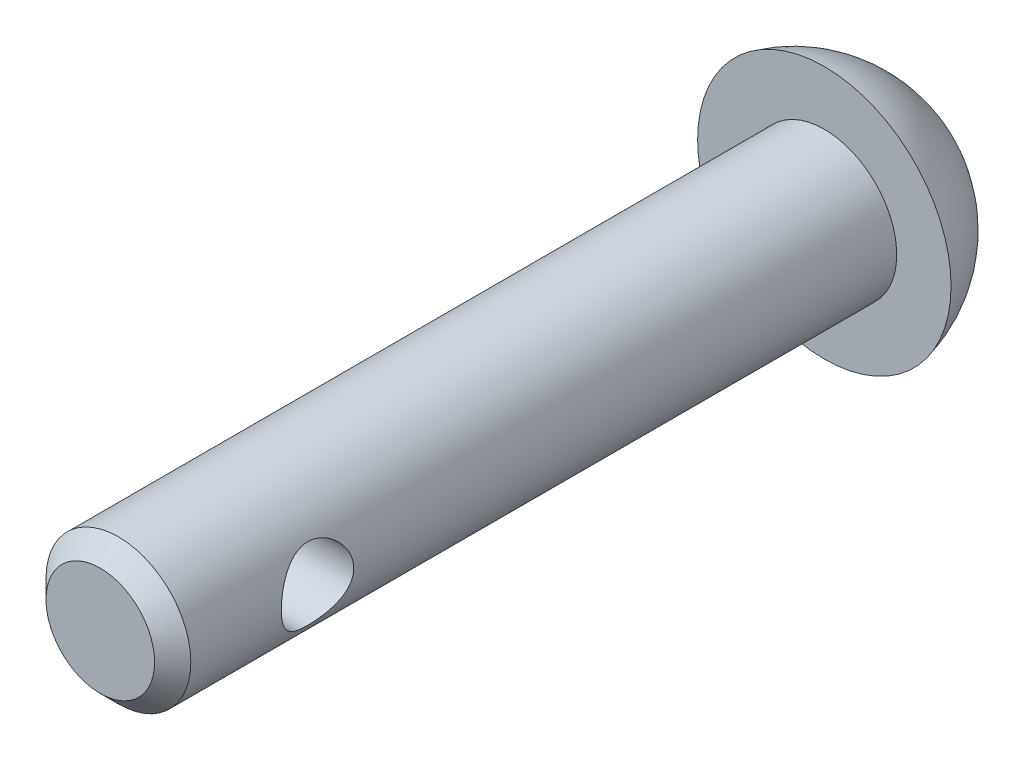
ISO-10303-21;
HEADER;
FILE_DESCRIPTION(('STEP AP214'),'2;1');
FILE_NAME('part.step','',(''),(''),'','','');
FILE_SCHEMA(('AUTOMOTIVE_DESIGN { 1 0 10303 214 1 1 1 1 }'));
ENDSEC;
DATA;
#1=APPLICATION_CONTEXT('core data for automotive mechanical design processes');
#2=APPLICATION_PROTOCOL_DEFINITION('international standard','automotive_design',2000,#1);
#3=PRODUCT_CONTEXT('',#1,'mechanical');
#4=PRODUCT('Part','Part','',(#3));
#5=PRODUCT_RELATED_PRODUCT_CATEGORY('part','',(#4));
#6=PRODUCT_DEFINITION_FORMATION('','',#4);
#7=PRODUCT_DEFINITION_CONTEXT('part definition',#1,'design');
#8=PRODUCT_DEFINITION('design','',#6,#7);
#9=PRODUCT_DEFINITION_SHAPE('','',#8);
#10=(LENGTH_UNIT() NAMED_UNIT(*) SI_UNIT(.MILLI.,.METRE.));
#11=(NAMED_UNIT(*) PLANE_ANGLE_UNIT() SI_UNIT($,.RADIAN.));
#12=(NAMED_UNIT(*) SI_UNIT($,.STERADIAN.) SOLID_ANGLE_UNIT());
#13=UNCERTAINTY_MEASURE_WITH_UNIT(LENGTH_MEASURE(1.E-05),#10,'distance_accuracy_value','');
#14=(GEOMETRIC_REPRESENTATION_CONTEXT(3) GLOBAL_UNCERTAINTY_ASSIGNED_CONTEXT((#13)) GLOBAL_UNIT_ASSIGNED_CONTEXT((#10,
#11,#12)) REPRESENTATION_CONTEXT('',''));
#15=CARTESIAN_POINT('',(0.,0.,0.));
#16=DIRECTION('',(0.,0.,1.));
#17=DIRECTION('',(1.,0.,0.));
#18=AXIS2_PLACEMENT_3D('',#15,#16,#17);
#19=CARTESIAN_POINT('',(0.,0.,10.));
#20=DIRECTION('',(0.,0.,-1.));
#21=DIRECTION('',(-1.,0.,0.));
#22=AXIS2_PLACEMENT_3D('',#19,#20,#21);
#23=CYLINDRICAL_SURFACE('',#22,2.);
#24=CARTESIAN_POINT('',(-2.,0.,7.));
#25=CARTESIAN_POINT('',(-1.99999713404151,-0.0525719629529865,6.9999966976805));
#26=CARTESIAN_POINT('',(-1.99790491019518,-0.105206599698033,6.99582992687832));
#27=CARTESIAN_POINT('',(-1.98974156037396,-0.208920235268425,6.97934711965908));
#28=CARTESIAN_POINT('',(-1.98366287828984,-0.259996086713504,6.96701560700235));
#29=CARTESIAN_POINT('',(-1.96816279403312,-0.358933544880574,6.9348061913832));
#30=CARTESIAN_POINT('',(-1.9587543917752,-0.40680680293918,6.91495761575199));
#31=CARTESIAN_POINT('',(-1.93745776515779,-0.498472616806565,6.86842937863506));
#32=CARTESIAN_POINT('',(-1.9255697363353,-0.54226549399005,6.84175025575115));
#33=CARTESIAN_POINT('',(-1.89956258258057,-0.627507817761919,6.7804827505147));
#34=CARTESIAN_POINT('',(-1.88535199127536,-0.668655211122112,6.74551352076036));
#35=CARTESIAN_POINT('',(-1.85659970246744,-0.744779444866977,6.66947852075296));
#36=CARTESIAN_POINT('',(-1.84205776209035,-0.779751583106766,6.62840814822756));
#37=CARTESIAN_POINT('',(-1.81298951197347,-0.845252000450278,6.53751665047662));
#38=CARTESIAN_POINT('',(-1.79855186970132,-0.875225335551637,6.48726390165409));
#39=CARTESIAN_POINT('',(-1.77285978772321,-0.926168226890695,6.38163266401378));
#40=CARTESIAN_POINT('',(-1.7616030760699,-0.947144214966334,6.32625787127725));
#41=CARTESIAN_POINT('',(-1.74457867037809,-0.978132442188588,6.21533489457808));
#42=CARTESIAN_POINT('',(-1.73852271583714,-0.988725857080441,6.1599955479326));
#43=CARTESIAN_POINT('',(-1.73181889948528,-1.00042699330885,6.04802116222052));
#44=CARTESIAN_POINT('',(-1.73116569343288,-1.00154408837307,5.99138745912884));
#45=CARTESIAN_POINT('',(-1.73510930257248,-0.994687287172294,5.88571397568463));
#46=CARTESIAN_POINT('',(-1.73908763662014,-0.987784559536822,5.83657596877695));
#47=CARTESIAN_POINT('',(-1.7507622873385,-0.966939849056932,5.74027809062696));
#48=CARTESIAN_POINT('',(-1.75845978831776,-0.952995623897652,5.69311885469468));
#49=CARTESIAN_POINT('',(-1.77687476412741,-0.918209780386003,5.60077086743434));
#50=CARTESIAN_POINT('',(-1.78765840663999,-0.897215067115994,5.55565360121421));
#51=CARTESIAN_POINT('',(-1.81103404281404,-0.849041687668002,5.46936570740999));
#52=CARTESIAN_POINT('',(-1.82362684780191,-0.821860243812467,5.42819686439991));
#53=CARTESIAN_POINT('',(-1.85113157903286,-0.758066054912788,5.34547874725677));
#54=CARTESIAN_POINT('',(-1.86613510236746,-0.720694458369281,5.30454312642384));
#55=CARTESIAN_POINT('',(-1.89547623300407,-0.639555578741373,5.2292645814091));
#56=CARTESIAN_POINT('',(-1.90981351958801,-0.595785256574285,5.19492480796612));
#57=CARTESIAN_POINT('',(-1.93701987282964,-0.500516505831848,5.13231433897027));
#58=CARTESIAN_POINT('',(-1.94978984162007,-0.448753591599408,5.10439952755426));
#59=CARTESIAN_POINT('',(-1.97157881121242,-0.340466215488797,5.05790297095699));
#60=CARTESIAN_POINT('',(-1.98060078943553,-0.283945576265277,5.03931381498483));
#61=CARTESIAN_POINT('',(-1.99324333741436,-0.172766491660702,5.01352459628332));
#62=CARTESIAN_POINT('',(-1.99724938301312,-0.118341530548324,5.00550876425322));
#63=CARTESIAN_POINT('',(-2.00073013459102,-0.00877959994935354,4.99853526886551));
#64=CARTESIAN_POINT('',(-2.00020698721312,0.0463570198699015,4.99957331436052));
#65=CARTESIAN_POINT('',(-1.99491192253441,0.151232971985994,5.01020668841875));
#66=CARTESIAN_POINT('',(-1.9904724568819,0.201059408049954,5.01913253273003));
#67=CARTESIAN_POINT('',(-1.97822171314819,0.298406892301917,5.04423807189508));
#68=CARTESIAN_POINT('',(-1.97041006334332,0.345927685690997,5.06041856645336));
#69=CARTESIAN_POINT('',(-1.95184251413669,0.438888608449665,5.09999846643317));
#70=CARTESIAN_POINT('',(-1.94100881769939,0.484230397006154,5.12359105011681));
#71=CARTESIAN_POINT('',(-1.91743974317109,0.570461361698921,5.17710753564604));
#72=CARTESIAN_POINT('',(-1.90470355565785,0.611348629775282,5.20703413459343));
#73=CARTESIAN_POINT('',(-1.87708221337464,0.691767689290653,5.27576042533287));
#74=CARTESIAN_POINT('',(-1.86210884848441,0.730772077824639,5.31514286845356));
#75=CARTESIAN_POINT('',(-1.83262391603874,0.80185632111324,5.3999251512693));
#76=CARTESIAN_POINT('',(-1.81811267381526,0.833931385690841,5.44532911881637));
#77=CARTESIAN_POINT('',(-1.79051192226068,0.891707914497696,5.54364365420031));
#78=CARTESIAN_POINT('',(-1.77752529663472,0.917025495878637,5.59681126620859));
#79=CARTESIAN_POINT('',(-1.75574072368126,0.958082826013803,5.70751006769252));
#80=CARTESIAN_POINT('',(-1.74693738240618,0.97383491588757,5.76503552650119));
#81=CARTESIAN_POINT('',(-1.73561501008667,0.993861687449679,5.87691022286145));
#82=CARTESIAN_POINT('',(-1.73257383460491,0.999092996400865,5.93103425342903));
#83=CARTESIAN_POINT('',(-1.73165354646175,1.00068915438079,6.03944706717073));
#84=CARTESIAN_POINT('',(-1.73377219627553,0.997057846624399,6.09373576873943));
#85=CARTESIAN_POINT('',(-1.74237862050025,0.981926125592263,6.19548350153201));
#86=CARTESIAN_POINT('',(-1.74843094482394,0.971208314342799,6.2431004701444));
#87=CARTESIAN_POINT('',(-1.76371016187918,0.943175358224645,6.3358081194247));
#88=CARTESIAN_POINT('',(-1.77293807569676,0.92585809115981,6.38089798209197));
#89=CARTESIAN_POINT('',(-1.79428530364528,0.883815745300683,6.4706248509866));
#90=CARTESIAN_POINT('',(-1.80655722396191,0.858671137816458,6.5150279018297));
#91=CARTESIAN_POINT('',(-1.8323533163459,0.802150971636634,6.59927453618058));
#92=CARTESIAN_POINT('',(-1.84587813794522,0.770772171238648,6.63911573051849));
#93=CARTESIAN_POINT('',(-1.87462323159313,0.69820332666464,6.71814198235761));
#94=CARTESIAN_POINT('',(-1.88984983311469,0.656284423010171,6.75665910236192));
#95=CARTESIAN_POINT('',(-1.91877752255088,0.566154806220279,6.82626298342363));
#96=CARTESIAN_POINT('',(-1.9324777860804,0.517940723256785,6.85734573942629));
#97=CARTESIAN_POINT('',(-1.95698009585103,0.415931596819947,6.9112363627622));
#98=CARTESIAN_POINT('',(-1.96776096562909,0.362099503934615,6.93398416941143));
#99=CARTESIAN_POINT('',(-1.98501341363465,0.250742101294192,6.96980816791895));
#100=CARTESIAN_POINT('',(-1.99149723372932,0.193227799623166,6.98291184682957));
#101=CARTESIAN_POINT('',(-1.99695461909663,0.112601946483384,6.99389741107585));
#102=CARTESIAN_POINT('',(-1.99809365339202,0.0901618794394986,6.99618264086362));
#103=CARTESIAN_POINT('',(-1.99961696977865,0.0451517318071577,6.9992346655168));
#104=CARTESIAN_POINT('',(-2.00000123103763,0.0225816476473814,7.0000014184712));
#105=CARTESIAN_POINT('',(-2.,0.,7.));
#106=B_SPLINE_CURVE_WITH_KNOTS('',3,(#24,#25,#26,#27,#28,#29,#30,#31,#32,#33,#34,#35,#36,#37,
#38,#39,#40,#41,#42,#43,#44,#45,#46,#47,#48,#49,#50,#51,#52,#53,#54,#55,#56,#57,#58,#59,#60,#61,
#62,#63,#64,#65,#66,#67,#68,#69,#70,#71,#72,#73,#74,#75,#76,#77,#78,#79,#80,#81,#82,#83,#84,#85,
#86,#87,#88,#89,#90,#91,#92,#93,#94,#95,#96,#97,#98,#99,#100,#101,#102,#103,#104,#105),
.UNSPECIFIED.,.T.,.F.,(4,2,2,2,2,2,2,2,2,2,2,2,2,2,2,2,2,2,2,2,2,2,2,2,2,2,2,2,2,2,2,2,2,2,2,2,
2,2,2,2,4),(0.,0.157624257420293,0.315548149709198,0.472862155492299,0.630163760581568,
0.796981758718089,0.963926237654035,1.14381726430753,1.32357947898281,1.49258012140229,
1.6614135732902,1.8100571240932,1.95874803925678,2.11090240168487,2.26312521260222,
2.43464941333878,2.60625534598686,2.78583022214441,2.96526216912279,3.12983290471346,
3.29432564511476,3.44606906506122,3.59782921630931,3.75392856027899,3.91009450748339,
4.08159610644419,4.25321588615432,4.43314682159674,4.61284511940778,4.77529307498373,
4.93767059860005,5.08457930244183,5.23153528783678,5.38836456775614,5.54527561138958,
5.72125242752498,5.89732383376572,6.07464013662925,6.2514490862493,6.31915280137697,
6.38685838514847),.UNSPECIFIED.);
#107=CARTESIAN_POINT('',(-2.,0.,7.));
#108=VERTEX_POINT('',#107);
#109=EDGE_CURVE('E48',#108,#108,#106,.T.);
#110=ORIENTED_EDGE('',*,*,#109,.T.);
#111=EDGE_LOOP('',(#110));
#112=FACE_BOUND('',#111,.T.);
#113=CARTESIAN_POINT('',(2.,0.,5.));
#114=CARTESIAN_POINT('',(1.99999713404151,-0.0525719629529865,5.0000033023195));
#115=CARTESIAN_POINT('',(1.99790491019518,-0.105206599698033,5.00417007312167));
#116=CARTESIAN_POINT('',(1.98974156037396,-0.208920235268425,5.02065288034092));
#117=CARTESIAN_POINT('',(1.98366287828984,-0.259996086713504,5.03298439299765));
#118=CARTESIAN_POINT('',(1.96816279403312,-0.358933544880574,5.06519380861679));
#119=CARTESIAN_POINT('',(1.9587543917752,-0.40680680293918,5.08504238424801));
#120=CARTESIAN_POINT('',(1.93745776515779,-0.498472616806565,5.13157062136494));
#121=CARTESIAN_POINT('',(1.9255697363353,-0.54226549399005,5.15824974424885));
#122=CARTESIAN_POINT('',(1.89956258258057,-0.627507817761919,5.2195172494853));
#123=CARTESIAN_POINT('',(1.88535199127536,-0.668655211122111,5.25448647923964));
#124=CARTESIAN_POINT('',(1.85659970246744,-0.744779444866977,5.33052147924703));
#125=CARTESIAN_POINT('',(1.84205776209035,-0.779751583106766,5.37159185177244));
#126=CARTESIAN_POINT('',(1.81298951197347,-0.845252000450278,5.46248334952338));
#127=CARTESIAN_POINT('',(1.79855186970132,-0.875225335551637,5.51273609834591));
#128=CARTESIAN_POINT('',(1.77285978772321,-0.926168226890695,5.61836733598621));
#129=CARTESIAN_POINT('',(1.7616030760699,-0.947144214966334,5.67374212872275));
#130=CARTESIAN_POINT('',(1.74457867037809,-0.978132442188588,5.78466510542192));
#131=CARTESIAN_POINT('',(1.73852271583714,-0.988725857080441,5.84000445206739));
#132=CARTESIAN_POINT('',(1.73181889948528,-1.00042699330885,5.95197883777948));
#133=CARTESIAN_POINT('',(1.73116569343288,-1.00154408837307,6.00861254087115));
#134=CARTESIAN_POINT('',(1.73510930257248,-0.994687287172294,6.11428602431537));
#135=CARTESIAN_POINT('',(1.73908763662014,-0.987784559536821,6.16342403122305));
#136=CARTESIAN_POINT('',(1.7507622873385,-0.966939849056932,6.25972190937304));
#137=CARTESIAN_POINT('',(1.75845978831776,-0.952995623897651,6.30688114530531));
#138=CARTESIAN_POINT('',(1.77687476412741,-0.918209780386003,6.39922913256566));
#139=CARTESIAN_POINT('',(1.78765840663999,-0.897215067115994,6.44434639878579));
#140=CARTESIAN_POINT('',(1.81103404281404,-0.849041687668002,6.53063429259001));
#141=CARTESIAN_POINT('',(1.82362684780191,-0.821860243812467,6.57180313560009));
#142=CARTESIAN_POINT('',(1.85113157903286,-0.758066054912788,6.65452125274322));
#143=CARTESIAN_POINT('',(1.86613510236746,-0.720694458369281,6.69545687357616));
#144=CARTESIAN_POINT('',(1.89547623300407,-0.639555578741373,6.7707354185909));
#145=CARTESIAN_POINT('',(1.90981351958801,-0.595785256574285,6.80507519203388));
#146=CARTESIAN_POINT('',(1.93701987282964,-0.500516505831848,6.86768566102972));
#147=CARTESIAN_POINT('',(1.94978984162007,-0.448753591599408,6.89560047244574));
#148=CARTESIAN_POINT('',(1.97157881121242,-0.340466215488797,6.94209702904301));
#149=CARTESIAN_POINT('',(1.98060078943553,-0.283945576265277,6.96068618501517));
#150=CARTESIAN_POINT('',(1.99324333741436,-0.172766491660702,6.98647540371667));
#151=CARTESIAN_POINT('',(1.99724938301312,-0.118341530548324,6.99449123574678));
#152=CARTESIAN_POINT('',(2.00073013459102,-0.00877959994935354,7.00146473113449));
#153=CARTESIAN_POINT('',(2.00020698721312,0.0463570198699015,7.00042668563948));
#154=CARTESIAN_POINT('',(1.99491192253441,0.151232971985994,6.98979331158124));
#155=CARTESIAN_POINT('',(1.9904724568819,0.201059408049954,6.98086746726997));
#156=CARTESIAN_POINT('',(1.97822171314819,0.298406892301917,6.95576192810491));
#157=CARTESIAN_POINT('',(1.97041006334332,0.345927685690997,6.93958143354664));
#158=CARTESIAN_POINT('',(1.95184251413669,0.438888608449665,6.90000153356683));
#159=CARTESIAN_POINT('',(1.94100881769939,0.484230397006154,6.87640894988319));
#160=CARTESIAN_POINT('',(1.91743974317109,0.570461361698921,6.82289246435396));
#161=CARTESIAN_POINT('',(1.90470355565785,0.611348629775282,6.79296586540657));
#162=CARTESIAN_POINT('',(1.87708221337464,0.691767689290653,6.72423957466712));
#163=CARTESIAN_POINT('',(1.86210884848441,0.730772077824639,6.68485713154643));
#164=CARTESIAN_POINT('',(1.83262391603874,0.80185632111324,6.60007484873069));
#165=CARTESIAN_POINT('',(1.81811267381526,0.833931385690841,6.55467088118362));
#166=CARTESIAN_POINT('',(1.79051192226068,0.891707914497696,6.45635634579969));
#167=CARTESIAN_POINT('',(1.77752529663472,0.917025495878637,6.4031887337914));
#168=CARTESIAN_POINT('',(1.75574072368126,0.958082826013803,6.29248993230748));
#169=CARTESIAN_POINT('',(1.74693738240618,0.97383491588757,6.23496447349881));
#170=CARTESIAN_POINT('',(1.73561501008667,0.993861687449679,6.12308977713855));
#171=CARTESIAN_POINT('',(1.73257383460491,0.999092996400865,6.06896574657096));
#172=CARTESIAN_POINT('',(1.73165354646175,1.00068915438079,5.96055293282927));
#173=CARTESIAN_POINT('',(1.73377219627553,0.997057846624399,5.90626423126056));
#174=CARTESIAN_POINT('',(1.74237862050025,0.981926125592263,5.80451649846798));
#175=CARTESIAN_POINT('',(1.74843094482394,0.971208314342799,5.7568995298556));
#176=CARTESIAN_POINT('',(1.76371016187917,0.943175358224645,5.66419188057529));
#177=CARTESIAN_POINT('',(1.77293807569676,0.92585809115981,5.61910201790803));
#178=CARTESIAN_POINT('',(1.79428530364528,0.883815745300683,5.52937514901339));
#179=CARTESIAN_POINT('',(1.80655722396191,0.858671137816458,5.4849720981703));
#180=CARTESIAN_POINT('',(1.8323533163459,0.802150971636634,5.40072546381941));
#181=CARTESIAN_POINT('',(1.84587813794522,0.770772171238648,5.36088426948151));
#182=CARTESIAN_POINT('',(1.87462323159313,0.69820332666464,5.28185801764238));
#183=CARTESIAN_POINT('',(1.88984983311469,0.656284423010171,5.24334089763808));
#184=CARTESIAN_POINT('',(1.91877752255088,0.566154806220279,5.17373701657637));
#185=CARTESIAN_POINT('',(1.9324777860804,0.517940723256785,5.14265426057371));
#186=CARTESIAN_POINT('',(1.95698009585103,0.415931596819947,5.08876363723779));
#187=CARTESIAN_POINT('',(1.96776096562909,0.362099503934615,5.06601583058856));
#188=CARTESIAN_POINT('',(1.98501341363465,0.250742101294192,5.03019183208105));
#189=CARTESIAN_POINT('',(1.99149723372932,0.193227799623166,5.01708815317042));
#190=CARTESIAN_POINT('',(1.99695461909663,0.112601946483384,5.00610258892415));
#191=CARTESIAN_POINT('',(1.99809365339202,0.0901618794394986,5.00381735913638));
#192=CARTESIAN_POINT('',(1.99961696977865,0.0451517318071577,5.00076533448319));
#193=CARTESIAN_POINT('',(2.00000123103763,0.0225816476473814,4.9999985815288));
#194=CARTESIAN_POINT('',(2.,0.,5.));
#195=B_SPLINE_CURVE_WITH_KNOTS('',3,(#113,#114,#115,#116,#117,#118,#119,#120,#121,#122,#123,
#124,#125,#126,#127,#128,#129,#130,#131,#132,#133,#134,#135,#136,#137,#138,#139,#140,#141,#142,
#143,#144,#145,#146,#147,#148,#149,#150,#151,#152,#153,#154,#155,#156,#157,#158,#159,#160,#161,
#162,#163,#164,#165,#166,#167,#168,#169,#170,#171,#172,#173,#174,#175,#176,#177,#178,#179,#180,
#181,#182,#183,#184,#185,#186,#187,#188,#189,#190,#191,#192,#193,#194),.UNSPECIFIED.,.T.,.F.,(4,
2,2,2,2,2,2,2,2,2,2,2,2,2,2,2,2,2,2,2,2,2,2,2,2,2,2,2,2,2,2,2,2,2,2,2,2,2,2,2,4),(0.,
0.157624257420293,0.315548149709198,0.472862155492299,0.630163760581568,0.796981758718088,
0.963926237654035,1.14381726430753,1.32357947898281,1.4925801214023,1.6614135732902,
1.81005712409321,1.95874803925678,2.11090240168487,2.26312521260222,2.43464941333878,
2.60625534598686,2.78583022214441,2.96526216912279,3.12983290471346,3.29432564511476,
3.44606906506122,3.59782921630931,3.75392856027899,3.91009450748339,4.08159610644419,
4.25321588615432,4.43314682159674,4.61284511940778,4.77529307498373,4.93767059860005,
5.08457930244183,5.23153528783678,5.38836456775614,5.54527561138958,5.72125242752498,
5.89732383376572,6.07464013662925,6.2514490862493,6.31915280137697,6.38685838514847),.UNSPECIFIED.);
#196=CARTESIAN_POINT('',(2.,0.,5.));
#197=VERTEX_POINT('',#196);
#198=EDGE_CURVE('E64',#197,#197,#195,.T.);
#199=ORIENTED_EDGE('',*,*,#198,.T.);
#200=EDGE_LOOP('',(#199));
#201=FACE_BOUND('',#200,.T.);
#202=CARTESIAN_POINT('',(0.,0.,9.5));
#203=DIRECTION('',(0.,0.,1.));
#204=DIRECTION('',(1.,0.,0.));
#205=AXIS2_PLACEMENT_3D('',#202,#203,#204);
#206=CIRCLE('',#205,2.);
#207=CARTESIAN_POINT('',(2.,0.,9.5));
#208=VERTEX_POINT('',#207);
#209=EDGE_CURVE('E10',#208,#208,#206,.F.);
#210=ORIENTED_EDGE('',*,*,#209,.T.);
#211=EDGE_LOOP('',(#210));
#212=FACE_BOUND('',#211,.T.);
#213=CARTESIAN_POINT('',(0.,0.,-10.));
#214=DIRECTION('',(0.,0.,-1.));
#215=DIRECTION('',(-1.,0.,0.));
#216=AXIS2_PLACEMENT_3D('',#213,#214,#215);
#217=CIRCLE('',#216,2.);
#218=CARTESIAN_POINT('',(-2.,0.,-10.));
#219=VERTEX_POINT('',#218);
#220=EDGE_CURVE('E61',#219,#219,#217,.T.);
#221=ORIENTED_EDGE('',*,*,#220,.F.);
#222=EDGE_LOOP('',(#221));
#223=FACE_BOUND('',#222,.T.);
#224=ADVANCED_FACE('F43',(#112,#201,#212,#223),#23,.T.);
#225=CARTESIAN_POINT('',(0.,0.,10.));
#226=DIRECTION('',(0.,0.,1.));
#227=DIRECTION('',(1.,0.,0.));
#228=AXIS2_PLACEMENT_3D('',#225,#226,#227);
#229=PLANE('',#228);
#230=CARTESIAN_POINT('',(0.,0.,10.));
#231=DIRECTION('',(0.,0.,1.));
#232=DIRECTION('',(1.,0.,0.));
#233=AXIS2_PLACEMENT_3D('',#230,#231,#232);
#234=CIRCLE('',#233,1.5);
#235=CARTESIAN_POINT('',(1.5,0.,10.));
#236=VERTEX_POINT('',#235);
#237=EDGE_CURVE('E56',#236,#236,#234,.T.);
#238=ORIENTED_EDGE('',*,*,#237,.T.);
#239=EDGE_LOOP('',(#238));
#240=FACE_BOUND('',#239,.T.);
#241=ADVANCED_FACE('F84',(#240),#229,.T.);
#242=CARTESIAN_POINT('',(0.,0.,10.));
#243=DIRECTION('',(0.,0.,-1.));
#244=DIRECTION('',(-1.,0.,0.));
#245=AXIS2_PLACEMENT_3D('',#242,#243,#244);
#246=CONICAL_SURFACE('',#245,1.5,0.785398163397445);
#247=ORIENTED_EDGE('',*,*,#209,.F.);
#248=EDGE_LOOP('',(#247));
#249=FACE_BOUND('',#248,.T.);
#250=ORIENTED_EDGE('',*,*,#237,.F.);
#251=EDGE_LOOP('',(#250));
#252=FACE_BOUND('',#251,.T.);
#253=ADVANCED_FACE('F46',(#249,#252),#246,.T.);
#254=CARTESIAN_POINT('',(0.,0.,-10.));
#255=DIRECTION('',(0.,0.,-1.));
#256=DIRECTION('',(-1.,0.,0.));
#257=AXIS2_PLACEMENT_3D('',#254,#255,#256);
#258=PLANE('',#257);
#259=ORIENTED_EDGE('',*,*,#220,.T.);
#260=EDGE_LOOP('',(#259));
#261=FACE_BOUND('',#260,.T.);
#262=CARTESIAN_POINT('',(0.,0.,-10.));
#263=DIRECTION('',(0.,0.,1.));
#264=DIRECTION('',(1.,0.,0.));
#265=AXIS2_PLACEMENT_3D('',#262,#263,#264);
#266=CIRCLE('',#265,3.5);
#267=CARTESIAN_POINT('',(3.5,0.,-10.));
#268=VERTEX_POINT('',#267);
#269=EDGE_CURVE('E104',#268,#268,#266,.T.);
#270=ORIENTED_EDGE('',*,*,#269,.T.);
#271=EDGE_LOOP('',(#270));
#272=FACE_BOUND('',#271,.T.);
#273=ADVANCED_FACE('F80',(#261,#272),#258,.F.);
#274=CARTESIAN_POINT('',(0.,0.,-9.15738502268237));
#275=DIRECTION('',(0.,0.,1.));
#276=DIRECTION('',(0.,1.,0.));
#277=AXIS2_PLACEMENT_3D('',#274,#275,#276);
#278=SPHERICAL_SURFACE('',#277,3.6);
#279=ORIENTED_EDGE('',*,*,#269,.F.);
#280=EDGE_LOOP('',(#279));
#281=FACE_BOUND('',#280,.T.);
#282=ADVANCED_FACE('F75',(#281),#278,.T.);
#283=CARTESIAN_POINT('',(-10.,0.,6.));
#284=DIRECTION('',(1.,0.,0.));
#285=DIRECTION('',(0.,0.,-1.));
#286=AXIS2_PLACEMENT_3D('',#283,#284,#285);
#287=CYLINDRICAL_SURFACE('',#286,1.);
#288=ORIENTED_EDGE('',*,*,#198,.F.);
#289=EDGE_LOOP('',(#288));
#290=FACE_BOUND('',#289,.T.);
#291=ORIENTED_EDGE('',*,*,#109,.F.);
#292=EDGE_LOOP('',(#291));
#293=FACE_BOUND('',#292,.T.);
#294=ADVANCED_FACE('F71',(#290,#293),#287,.F.);
#295=CLOSED_SHELL('',(#224,#241,#253,#273,#282,#294));
#296=MANIFOLD_SOLID_BREP('B2',#295);
#297=ADVANCED_BREP_SHAPE_REPRESENTATION('',(#18,#296),#14);
#298=SHAPE_DEFINITION_REPRESENTATION(#9,#297);
ENDSEC;
END-ISO-10303-21;
